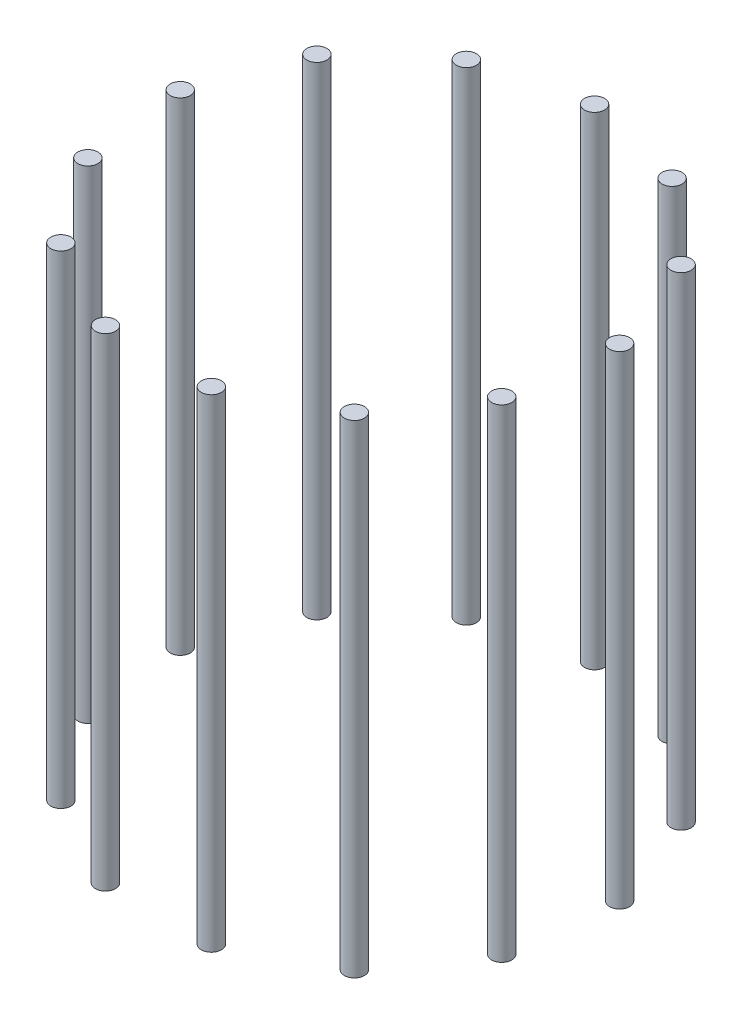
ISO-10303-21;
HEADER;
FILE_DESCRIPTION(('STEP AP214'),'2;1');
FILE_NAME('part.step','',(''),(''),'','','');
FILE_SCHEMA(('AUTOMOTIVE_DESIGN { 1 0 10303 214 1 1 1 1 }'));
ENDSEC;
DATA;
#1=APPLICATION_CONTEXT('core data for automotive mechanical design processes');
#2=APPLICATION_PROTOCOL_DEFINITION('international standard','automotive_design',2000,#1);
#3=PRODUCT_CONTEXT('',#1,'mechanical');
#4=PRODUCT('Part','Part','',(#3));
#5=PRODUCT_RELATED_PRODUCT_CATEGORY('part','',(#4));
#6=PRODUCT_DEFINITION_FORMATION('','',#4);
#7=PRODUCT_DEFINITION_CONTEXT('part definition',#1,'design');
#8=PRODUCT_DEFINITION('design','',#6,#7);
#9=PRODUCT_DEFINITION_SHAPE('','',#8);
#10=(LENGTH_UNIT() NAMED_UNIT(*) SI_UNIT(.MILLI.,.METRE.));
#11=(NAMED_UNIT(*) PLANE_ANGLE_UNIT() SI_UNIT($,.RADIAN.));
#12=(NAMED_UNIT(*) SI_UNIT($,.STERADIAN.) SOLID_ANGLE_UNIT());
#13=UNCERTAINTY_MEASURE_WITH_UNIT(LENGTH_MEASURE(1.E-05),#10,'distance_accuracy_value','');
#14=(GEOMETRIC_REPRESENTATION_CONTEXT(3) GLOBAL_UNCERTAINTY_ASSIGNED_CONTEXT((#13)) GLOBAL_UNIT_ASSIGNED_CONTEXT((#10,
#11,#12)) REPRESENTATION_CONTEXT('',''));
#15=CARTESIAN_POINT('',(0.,0.,0.));
#16=DIRECTION('',(0.,0.,1.));
#17=DIRECTION('',(1.,0.,0.));
#18=AXIS2_PLACEMENT_3D('',#15,#16,#17);
#19=CARTESIAN_POINT('',(-2.5559774462407,-12.,-4.87000814109254));
#20=DIRECTION('',(0.,1.,0.));
#21=DIRECTION('',(0.,0.,1.));
#22=AXIS2_PLACEMENT_3D('',#19,#20,#21);
#23=CYLINDRICAL_SURFACE('',#22,0.250000000000128);
#24=CARTESIAN_POINT('',(-2.5559774462407,-12.,-4.87000814109254));
#25=DIRECTION('',(0.,1.,0.));
#26=DIRECTION('',(0.,0.,1.));
#27=AXIS2_PLACEMENT_3D('',#24,#25,#26);
#28=CIRCLE('',#27,0.250000000000128);
#29=CARTESIAN_POINT('',(-2.5559774462407,-12.,-4.62000814109242));
#30=VERTEX_POINT('',#29);
#31=EDGE_CURVE('E11',#30,#30,#28,.T.);
#32=ORIENTED_EDGE('',*,*,#31,.T.);
#33=EDGE_LOOP('',(#32));
#34=FACE_BOUND('',#33,.T.);
#35=CARTESIAN_POINT('',(-2.5559774462407,0.,-4.87000814109254));
#36=DIRECTION('',(0.,1.,0.));
#37=DIRECTION('',(0.,0.,1.));
#38=AXIS2_PLACEMENT_3D('',#35,#36,#37);
#39=CIRCLE('',#38,0.250000000000128);
#40=CARTESIAN_POINT('',(-2.5559774462407,0.,-4.62000814109242));
#41=VERTEX_POINT('',#40);
#42=EDGE_CURVE('E42',#41,#41,#39,.T.);
#43=ORIENTED_EDGE('',*,*,#42,.F.);
#44=EDGE_LOOP('',(#43));
#45=FACE_BOUND('',#44,.T.);
#46=ADVANCED_FACE('F39',(#34,#45),#23,.T.);
#47=CARTESIAN_POINT('',(-2.5559774462407,-12.,-4.87000814109254));
#48=DIRECTION('',(0.,1.,0.));
#49=DIRECTION('',(0.,0.,1.));
#50=AXIS2_PLACEMENT_3D('',#47,#48,#49);
#51=PLANE('',#50);
#52=ORIENTED_EDGE('',*,*,#31,.F.);
#53=EDGE_LOOP('',(#52));
#54=FACE_BOUND('',#53,.T.);
#55=ADVANCED_FACE('F54',(#54),#51,.F.);
#56=CARTESIAN_POINT('',(-2.5559774462407,0.,-4.87000814109254));
#57=DIRECTION('',(0.,1.,0.));
#58=DIRECTION('',(0.,0.,1.));
#59=AXIS2_PLACEMENT_3D('',#56,#57,#58);
#60=PLANE('',#59);
#61=ORIENTED_EDGE('',*,*,#42,.T.);
#62=EDGE_LOOP('',(#61));
#63=FACE_BOUND('',#62,.T.);
#64=ADVANCED_FACE('F51',(#63),#60,.T.);
#65=CLOSED_SHELL('',(#46,#55,#64));
#66=MANIFOLD_SOLID_BREP('B2',#65);
#67=CARTESIAN_POINT('',(-4.52641126241501,-12.,-3.12435610702116));
#68=DIRECTION('',(0.,1.,0.));
#69=DIRECTION('',(0.,0.,1.));
#70=AXIS2_PLACEMENT_3D('',#67,#68,#69);
#71=CYLINDRICAL_SURFACE('',#70,0.250000000000218);
#72=CARTESIAN_POINT('',(-4.52641126241501,-12.,-3.12435610702116));
#73=DIRECTION('',(0.,1.,0.));
#74=DIRECTION('',(0.,0.,1.));
#75=AXIS2_PLACEMENT_3D('',#72,#73,#74);
#76=CIRCLE('',#75,0.250000000000218);
#77=CARTESIAN_POINT('',(-4.52641126241501,-12.,-2.87435610702095));
#78=VERTEX_POINT('',#77);
#79=EDGE_CURVE('E38',#78,#78,#76,.T.);
#80=ORIENTED_EDGE('',*,*,#79,.T.);
#81=EDGE_LOOP('',(#80));
#82=FACE_BOUND('',#81,.T.);
#83=CARTESIAN_POINT('',(-4.52641126241501,0.,-3.12435610702116));
#84=DIRECTION('',(0.,1.,0.));
#85=DIRECTION('',(0.,0.,1.));
#86=AXIS2_PLACEMENT_3D('',#83,#84,#85);
#87=CIRCLE('',#86,0.250000000000218);
#88=CARTESIAN_POINT('',(-4.52641126241501,0.,-2.87435610702095));
#89=VERTEX_POINT('',#88);
#90=EDGE_CURVE('E90',#89,#89,#87,.T.);
#91=ORIENTED_EDGE('',*,*,#90,.F.);
#92=EDGE_LOOP('',(#91));
#93=FACE_BOUND('',#92,.T.);
#94=ADVANCED_FACE('F87',(#82,#93),#71,.T.);
#95=CARTESIAN_POINT('',(-4.52641126241501,-12.,-3.12435610702116));
#96=DIRECTION('',(0.,1.,0.));
#97=DIRECTION('',(0.,0.,1.));
#98=AXIS2_PLACEMENT_3D('',#95,#96,#97);
#99=PLANE('',#98);
#100=ORIENTED_EDGE('',*,*,#79,.F.);
#101=EDGE_LOOP('',(#100));
#102=FACE_BOUND('',#101,.T.);
#103=ADVANCED_FACE('F102',(#102),#99,.F.);
#104=CARTESIAN_POINT('',(-4.52641126241501,0.,-3.12435610702116));
#105=DIRECTION('',(0.,1.,0.));
#106=DIRECTION('',(0.,0.,1.));
#107=AXIS2_PLACEMENT_3D('',#104,#105,#106);
#108=PLANE('',#107);
#109=ORIENTED_EDGE('',*,*,#90,.T.);
#110=EDGE_LOOP('',(#109));
#111=FACE_BOUND('',#110,.T.);
#112=ADVANCED_FACE('F99',(#111),#108,.T.);
#113=CLOSED_SHELL('',(#94,#103,#112));
#114=MANIFOLD_SOLID_BREP('B6',#113);
#115=CARTESIAN_POINT('',(-5.45989880753909,-12.,-0.662951741404041));
#116=DIRECTION('',(0.,1.,0.));
#117=DIRECTION('',(0.,0.,1.));
#118=AXIS2_PLACEMENT_3D('',#115,#116,#117);
#119=CYLINDRICAL_SURFACE('',#118,0.250000000000326);
#120=CARTESIAN_POINT('',(-5.45989880753909,-12.,-0.662951741404041));
#121=DIRECTION('',(0.,1.,0.));
#122=DIRECTION('',(0.,0.,1.));
#123=AXIS2_PLACEMENT_3D('',#120,#121,#122);
#124=CIRCLE('',#123,0.250000000000326);
#125=CARTESIAN_POINT('',(-5.45989880753909,-12.,-0.412951741403715));
#126=VERTEX_POINT('',#125);
#127=EDGE_CURVE('E86',#126,#126,#124,.T.);
#128=ORIENTED_EDGE('',*,*,#127,.T.);
#129=EDGE_LOOP('',(#128));
#130=FACE_BOUND('',#129,.T.);
#131=CARTESIAN_POINT('',(-5.45989880753909,0.,-0.662951741404041));
#132=DIRECTION('',(0.,1.,0.));
#133=DIRECTION('',(0.,0.,1.));
#134=AXIS2_PLACEMENT_3D('',#131,#132,#133);
#135=CIRCLE('',#134,0.250000000000326);
#136=CARTESIAN_POINT('',(-5.45989880753909,0.,-0.412951741403715));
#137=VERTEX_POINT('',#136);
#138=EDGE_CURVE('E138',#137,#137,#135,.T.);
#139=ORIENTED_EDGE('',*,*,#138,.F.);
#140=EDGE_LOOP('',(#139));
#141=FACE_BOUND('',#140,.T.);
#142=ADVANCED_FACE('F135',(#130,#141),#119,.T.);
#143=CARTESIAN_POINT('',(-5.45989880753909,-12.,-0.662951741404041));
#144=DIRECTION('',(0.,1.,0.));
#145=DIRECTION('',(0.,0.,1.));
#146=AXIS2_PLACEMENT_3D('',#143,#144,#145);
#147=PLANE('',#146);
#148=ORIENTED_EDGE('',*,*,#127,.F.);
#149=EDGE_LOOP('',(#148));
#150=FACE_BOUND('',#149,.T.);
#151=ADVANCED_FACE('F150',(#150),#147,.F.);
#152=CARTESIAN_POINT('',(-5.45989880753909,0.,-0.662951741404041));
#153=DIRECTION('',(0.,1.,0.));
#154=DIRECTION('',(0.,0.,1.));
#155=AXIS2_PLACEMENT_3D('',#152,#153,#154);
#156=PLANE('',#155);
#157=ORIENTED_EDGE('',*,*,#138,.T.);
#158=EDGE_LOOP('',(#157));
#159=FACE_BOUND('',#158,.T.);
#160=ADVANCED_FACE('F147',(#159),#156,.T.);
#161=CLOSED_SHELL('',(#142,#151,#160));
#162=MANIFOLD_SOLID_BREP('B33',#161);
#163=CARTESIAN_POINT('',(-5.14258933476946,-12.,1.95032687873417));
#164=DIRECTION('',(0.,1.,0.));
#165=DIRECTION('',(0.,0.,1.));
#166=AXIS2_PLACEMENT_3D('',#163,#164,#165);
#167=CYLINDRICAL_SURFACE('',#166,0.250000000000417);
#168=CARTESIAN_POINT('',(-5.14258933476946,-12.,1.95032687873417));
#169=DIRECTION('',(0.,1.,0.));
#170=DIRECTION('',(0.,0.,1.));
#171=AXIS2_PLACEMENT_3D('',#168,#169,#170);
#172=CIRCLE('',#171,0.250000000000417);
#173=CARTESIAN_POINT('',(-5.14258933476946,-12.,2.20032687873458));
#174=VERTEX_POINT('',#173);
#175=EDGE_CURVE('E134',#174,#174,#172,.T.);
#176=ORIENTED_EDGE('',*,*,#175,.T.);
#177=EDGE_LOOP('',(#176));
#178=FACE_BOUND('',#177,.T.);
#179=CARTESIAN_POINT('',(-5.14258933476946,0.,1.95032687873417));
#180=DIRECTION('',(0.,1.,0.));
#181=DIRECTION('',(0.,0.,1.));
#182=AXIS2_PLACEMENT_3D('',#179,#180,#181);
#183=CIRCLE('',#182,0.250000000000417);
#184=CARTESIAN_POINT('',(-5.14258933476946,0.,2.20032687873458));
#185=VERTEX_POINT('',#184);
#186=EDGE_CURVE('E186',#185,#185,#183,.T.);
#187=ORIENTED_EDGE('',*,*,#186,.F.);
#188=EDGE_LOOP('',(#187));
#189=FACE_BOUND('',#188,.T.);
#190=ADVANCED_FACE('F183',(#178,#189),#167,.T.);
#191=CARTESIAN_POINT('',(-5.14258933476946,-12.,1.95032687873417));
#192=DIRECTION('',(0.,1.,0.));
#193=DIRECTION('',(0.,0.,1.));
#194=AXIS2_PLACEMENT_3D('',#191,#192,#193);
#195=PLANE('',#194);
#196=ORIENTED_EDGE('',*,*,#175,.F.);
#197=EDGE_LOOP('',(#196));
#198=FACE_BOUND('',#197,.T.);
#199=ADVANCED_FACE('F198',(#198),#195,.F.);
#200=CARTESIAN_POINT('',(-5.14258933476946,0.,1.95032687873417));
#201=DIRECTION('',(0.,1.,0.));
#202=DIRECTION('',(0.,0.,1.));
#203=AXIS2_PLACEMENT_3D('',#200,#201,#202);
#204=PLANE('',#203);
#205=ORIENTED_EDGE('',*,*,#186,.T.);
#206=EDGE_LOOP('',(#205));
#207=FACE_BOUND('',#206,.T.);
#208=ADVANCED_FACE('F195',(#207),#204,.T.);
#209=CLOSED_SHELL('',(#190,#199,#208));
#210=MANIFOLD_SOLID_BREP('B81',#209);
#211=CARTESIAN_POINT('',(-3.64717462032396,-12.,4.11680911494121));
#212=DIRECTION('',(0.,1.,0.));
#213=DIRECTION('',(0.,0.,1.));
#214=AXIS2_PLACEMENT_3D('',#211,#212,#213);
#215=CYLINDRICAL_SURFACE('',#214,0.250000000000482);
#216=CARTESIAN_POINT('',(-3.64717462032396,-12.,4.11680911494121));
#217=DIRECTION('',(0.,1.,0.));
#218=DIRECTION('',(0.,0.,1.));
#219=AXIS2_PLACEMENT_3D('',#216,#217,#218);
#220=CIRCLE('',#219,0.250000000000482);
#221=CARTESIAN_POINT('',(-3.64717462032396,-12.,4.36680911494169));
#222=VERTEX_POINT('',#221);
#223=EDGE_CURVE('E182',#222,#222,#220,.T.);
#224=ORIENTED_EDGE('',*,*,#223,.T.);
#225=EDGE_LOOP('',(#224));
#226=FACE_BOUND('',#225,.T.);
#227=CARTESIAN_POINT('',(-3.64717462032396,0.,4.11680911494121));
#228=DIRECTION('',(0.,1.,0.));
#229=DIRECTION('',(0.,0.,1.));
#230=AXIS2_PLACEMENT_3D('',#227,#228,#229);
#231=CIRCLE('',#230,0.250000000000482);
#232=CARTESIAN_POINT('',(-3.64717462032396,0.,4.36680911494169));
#233=VERTEX_POINT('',#232);
#234=EDGE_CURVE('E234',#233,#233,#231,.T.);
#235=ORIENTED_EDGE('',*,*,#234,.F.);
#236=EDGE_LOOP('',(#235));
#237=FACE_BOUND('',#236,.T.);
#238=ADVANCED_FACE('F231',(#226,#237),#215,.T.);
#239=CARTESIAN_POINT('',(-3.64717462032396,-12.,4.11680911494121));
#240=DIRECTION('',(0.,1.,0.));
#241=DIRECTION('',(0.,0.,1.));
#242=AXIS2_PLACEMENT_3D('',#239,#240,#241);
#243=PLANE('',#242);
#244=ORIENTED_EDGE('',*,*,#223,.F.);
#245=EDGE_LOOP('',(#244));
#246=FACE_BOUND('',#245,.T.);
#247=ADVANCED_FACE('F246',(#246),#243,.F.);
#248=CARTESIAN_POINT('',(-3.64717462032396,0.,4.11680911494121));
#249=DIRECTION('',(0.,1.,0.));
#250=DIRECTION('',(0.,0.,1.));
#251=AXIS2_PLACEMENT_3D('',#248,#249,#250);
#252=PLANE('',#251);
#253=ORIENTED_EDGE('',*,*,#234,.T.);
#254=EDGE_LOOP('',(#253));
#255=FACE_BOUND('',#254,.T.);
#256=ADVANCED_FACE('F243',(#255),#252,.T.);
#257=CLOSED_SHELL('',(#238,#247,#256));
#258=MANIFOLD_SOLID_BREP('B129',#257);
#259=CARTESIAN_POINT('',(-1.31623615358111,-12.,5.34017999584334));
#260=DIRECTION('',(0.,1.,0.));
#261=DIRECTION('',(0.,0.,1.));
#262=AXIS2_PLACEMENT_3D('',#259,#260,#261);
#263=CYLINDRICAL_SURFACE('',#262,0.250000000000497);
#264=CARTESIAN_POINT('',(-1.31623615358111,-12.,5.34017999584334));
#265=DIRECTION('',(0.,1.,0.));
#266=DIRECTION('',(0.,0.,1.));
#267=AXIS2_PLACEMENT_3D('',#264,#265,#266);
#268=CIRCLE('',#267,0.250000000000497);
#269=CARTESIAN_POINT('',(-1.31623615358111,-12.,5.59017999584384));
#270=VERTEX_POINT('',#269);
#271=EDGE_CURVE('E230',#270,#270,#268,.T.);
#272=ORIENTED_EDGE('',*,*,#271,.T.);
#273=EDGE_LOOP('',(#272));
#274=FACE_BOUND('',#273,.T.);
#275=CARTESIAN_POINT('',(-1.31623615358111,0.,5.34017999584334));
#276=DIRECTION('',(0.,1.,0.));
#277=DIRECTION('',(0.,0.,1.));
#278=AXIS2_PLACEMENT_3D('',#275,#276,#277);
#279=CIRCLE('',#278,0.250000000000497);
#280=CARTESIAN_POINT('',(-1.31623615358111,0.,5.59017999584384));
#281=VERTEX_POINT('',#280);
#282=EDGE_CURVE('E282',#281,#281,#279,.T.);
#283=ORIENTED_EDGE('',*,*,#282,.F.);
#284=EDGE_LOOP('',(#283));
#285=FACE_BOUND('',#284,.T.);
#286=ADVANCED_FACE('F279',(#274,#285),#263,.T.);
#287=CARTESIAN_POINT('',(-1.31623615358111,-12.,5.34017999584334));
#288=DIRECTION('',(0.,1.,0.));
#289=DIRECTION('',(0.,0.,1.));
#290=AXIS2_PLACEMENT_3D('',#287,#288,#289);
#291=PLANE('',#290);
#292=ORIENTED_EDGE('',*,*,#271,.F.);
#293=EDGE_LOOP('',(#292));
#294=FACE_BOUND('',#293,.T.);
#295=ADVANCED_FACE('F294',(#294),#291,.F.);
#296=CARTESIAN_POINT('',(-1.31623615358111,0.,5.34017999584334));
#297=DIRECTION('',(0.,1.,0.));
#298=DIRECTION('',(0.,0.,1.));
#299=AXIS2_PLACEMENT_3D('',#296,#297,#298);
#300=PLANE('',#299);
#301=ORIENTED_EDGE('',*,*,#282,.T.);
#302=EDGE_LOOP('',(#301));
#303=FACE_BOUND('',#302,.T.);
#304=ADVANCED_FACE('F291',(#303),#300,.T.);
#305=CLOSED_SHELL('',(#286,#295,#304));
#306=MANIFOLD_SOLID_BREP('B177',#305);
#307=CARTESIAN_POINT('',(1.31623615358203,-12.,5.34017999584323));
#308=DIRECTION('',(0.,1.,0.));
#309=DIRECTION('',(0.,0.,1.));
#310=AXIS2_PLACEMENT_3D('',#307,#308,#309);
#311=CYLINDRICAL_SURFACE('',#310,0.250000000000458);
#312=CARTESIAN_POINT('',(1.31623615358203,-12.,5.34017999584323));
#313=DIRECTION('',(0.,1.,0.));
#314=DIRECTION('',(0.,0.,1.));
#315=AXIS2_PLACEMENT_3D('',#312,#313,#314);
#316=CIRCLE('',#315,0.250000000000458);
#317=CARTESIAN_POINT('',(1.31623615358203,-12.,5.59017999584369));
#318=VERTEX_POINT('',#317);
#319=EDGE_CURVE('E278',#318,#318,#316,.T.);
#320=ORIENTED_EDGE('',*,*,#319,.T.);
#321=EDGE_LOOP('',(#320));
#322=FACE_BOUND('',#321,.T.);
#323=CARTESIAN_POINT('',(1.31623615358203,0.,5.34017999584323));
#324=DIRECTION('',(0.,1.,0.));
#325=DIRECTION('',(0.,0.,1.));
#326=AXIS2_PLACEMENT_3D('',#323,#324,#325);
#327=CIRCLE('',#326,0.250000000000458);
#328=CARTESIAN_POINT('',(1.31623615358203,0.,5.59017999584369));
#329=VERTEX_POINT('',#328);
#330=EDGE_CURVE('E330',#329,#329,#327,.T.);
#331=ORIENTED_EDGE('',*,*,#330,.F.);
#332=EDGE_LOOP('',(#331));
#333=FACE_BOUND('',#332,.T.);
#334=ADVANCED_FACE('F327',(#322,#333),#311,.T.);
#335=CARTESIAN_POINT('',(1.31623615358203,-12.,5.34017999584323));
#336=DIRECTION('',(0.,1.,0.));
#337=DIRECTION('',(0.,0.,1.));
#338=AXIS2_PLACEMENT_3D('',#335,#336,#337);
#339=PLANE('',#338);
#340=ORIENTED_EDGE('',*,*,#319,.F.);
#341=EDGE_LOOP('',(#340));
#342=FACE_BOUND('',#341,.T.);
#343=ADVANCED_FACE('F342',(#342),#339,.F.);
#344=CARTESIAN_POINT('',(1.31623615358203,0.,5.34017999584323));
#345=DIRECTION('',(0.,1.,0.));
#346=DIRECTION('',(0.,0.,1.));
#347=AXIS2_PLACEMENT_3D('',#344,#345,#346);
#348=PLANE('',#347);
#349=ORIENTED_EDGE('',*,*,#330,.T.);
#350=EDGE_LOOP('',(#349));
#351=FACE_BOUND('',#350,.T.);
#352=ADVANCED_FACE('F339',(#351),#348,.T.);
#353=CLOSED_SHELL('',(#334,#343,#352));
#354=MANIFOLD_SOLID_BREP('B225',#353);
#355=CARTESIAN_POINT('',(3.64717462032478,-12.,4.1168091149409));
#356=DIRECTION('',(0.,1.,0.));
#357=DIRECTION('',(0.,0.,1.));
#358=AXIS2_PLACEMENT_3D('',#355,#356,#357);
#359=CYLINDRICAL_SURFACE('',#358,0.250000000000372);
#360=CARTESIAN_POINT('',(3.64717462032478,-12.,4.1168091149409));
#361=DIRECTION('',(0.,1.,0.));
#362=DIRECTION('',(0.,0.,1.));
#363=AXIS2_PLACEMENT_3D('',#360,#361,#362);
#364=CIRCLE('',#363,0.250000000000372);
#365=CARTESIAN_POINT('',(3.64717462032478,-12.,4.36680911494127));
#366=VERTEX_POINT('',#365);
#367=EDGE_CURVE('E326',#366,#366,#364,.T.);
#368=ORIENTED_EDGE('',*,*,#367,.T.);
#369=EDGE_LOOP('',(#368));
#370=FACE_BOUND('',#369,.T.);
#371=CARTESIAN_POINT('',(3.64717462032478,0.,4.1168091149409));
#372=DIRECTION('',(0.,1.,0.));
#373=DIRECTION('',(0.,0.,1.));
#374=AXIS2_PLACEMENT_3D('',#371,#372,#373);
#375=CIRCLE('',#374,0.250000000000372);
#376=CARTESIAN_POINT('',(3.64717462032478,0.,4.36680911494127));
#377=VERTEX_POINT('',#376);
#378=EDGE_CURVE('E378',#377,#377,#375,.T.);
#379=ORIENTED_EDGE('',*,*,#378,.F.);
#380=EDGE_LOOP('',(#379));
#381=FACE_BOUND('',#380,.T.);
#382=ADVANCED_FACE('F375',(#370,#381),#359,.T.);
#383=CARTESIAN_POINT('',(3.64717462032478,-12.,4.1168091149409));
#384=DIRECTION('',(0.,1.,0.));
#385=DIRECTION('',(0.,0.,1.));
#386=AXIS2_PLACEMENT_3D('',#383,#384,#385);
#387=PLANE('',#386);
#388=ORIENTED_EDGE('',*,*,#367,.F.);
#389=EDGE_LOOP('',(#388));
#390=FACE_BOUND('',#389,.T.);
#391=ADVANCED_FACE('F390',(#390),#387,.F.);
#392=CARTESIAN_POINT('',(3.64717462032478,0.,4.1168091149409));
#393=DIRECTION('',(0.,1.,0.));
#394=DIRECTION('',(0.,0.,1.));
#395=AXIS2_PLACEMENT_3D('',#392,#393,#394);
#396=PLANE('',#395);
#397=ORIENTED_EDGE('',*,*,#378,.T.);
#398=EDGE_LOOP('',(#397));
#399=FACE_BOUND('',#398,.T.);
#400=ADVANCED_FACE('F387',(#399),#396,.T.);
#401=CLOSED_SHELL('',(#382,#391,#400));
#402=MANIFOLD_SOLID_BREP('B273',#401);
#403=CARTESIAN_POINT('',(5.1425893347701,-12.,1.95032687873373));
#404=DIRECTION('',(0.,1.,0.));
#405=DIRECTION('',(0.,0.,1.));
#406=AXIS2_PLACEMENT_3D('',#403,#404,#405);
#407=CYLINDRICAL_SURFACE('',#406,0.250000000000262);
#408=CARTESIAN_POINT('',(5.1425893347701,-12.,1.95032687873373));
#409=DIRECTION('',(0.,1.,0.));
#410=DIRECTION('',(0.,0.,1.));
#411=AXIS2_PLACEMENT_3D('',#408,#409,#410);
#412=CIRCLE('',#411,0.250000000000262);
#413=CARTESIAN_POINT('',(5.1425893347701,-12.,2.20032687873399));
#414=VERTEX_POINT('',#413);
#415=EDGE_CURVE('E374',#414,#414,#412,.T.);
#416=ORIENTED_EDGE('',*,*,#415,.T.);
#417=EDGE_LOOP('',(#416));
#418=FACE_BOUND('',#417,.T.);
#419=CARTESIAN_POINT('',(5.1425893347701,0.,1.95032687873373));
#420=DIRECTION('',(0.,1.,0.));
#421=DIRECTION('',(0.,0.,1.));
#422=AXIS2_PLACEMENT_3D('',#419,#420,#421);
#423=CIRCLE('',#422,0.250000000000262);
#424=CARTESIAN_POINT('',(5.1425893347701,0.,2.20032687873399));
#425=VERTEX_POINT('',#424);
#426=EDGE_CURVE('E426',#425,#425,#423,.T.);
#427=ORIENTED_EDGE('',*,*,#426,.F.);
#428=EDGE_LOOP('',(#427));
#429=FACE_BOUND('',#428,.T.);
#430=ADVANCED_FACE('F423',(#418,#429),#407,.T.);
#431=CARTESIAN_POINT('',(5.1425893347701,-12.,1.95032687873373));
#432=DIRECTION('',(0.,1.,0.));
#433=DIRECTION('',(0.,0.,1.));
#434=AXIS2_PLACEMENT_3D('',#431,#432,#433);
#435=PLANE('',#434);
#436=ORIENTED_EDGE('',*,*,#415,.F.);
#437=EDGE_LOOP('',(#436));
#438=FACE_BOUND('',#437,.T.);
#439=ADVANCED_FACE('F438',(#438),#435,.F.);
#440=CARTESIAN_POINT('',(5.1425893347701,0.,1.95032687873373));
#441=DIRECTION('',(0.,1.,0.));
#442=DIRECTION('',(0.,0.,1.));
#443=AXIS2_PLACEMENT_3D('',#440,#441,#442);
#444=PLANE('',#443);
#445=ORIENTED_EDGE('',*,*,#426,.T.);
#446=EDGE_LOOP('',(#445));
#447=FACE_BOUND('',#446,.T.);
#448=ADVANCED_FACE('F435',(#447),#444,.T.);
#449=CLOSED_SHELL('',(#430,#439,#448));
#450=MANIFOLD_SOLID_BREP('B321',#449);
#451=CARTESIAN_POINT('',(5.4598988075395,-12.,-0.66295174140451));
#452=DIRECTION('',(0.,1.,0.));
#453=DIRECTION('',(0.,0.,1.));
#454=AXIS2_PLACEMENT_3D('',#451,#452,#453);
#455=CYLINDRICAL_SURFACE('',#454,0.250000000000146);
#456=CARTESIAN_POINT('',(5.4598988075395,-12.,-0.66295174140451));
#457=DIRECTION('',(0.,1.,0.));
#458=DIRECTION('',(0.,0.,1.));
#459=AXIS2_PLACEMENT_3D('',#456,#457,#458);
#460=CIRCLE('',#459,0.250000000000146);
#461=CARTESIAN_POINT('',(5.4598988075395,-12.,-0.412951741404363));
#462=VERTEX_POINT('',#461);
#463=EDGE_CURVE('E422',#462,#462,#460,.T.);
#464=ORIENTED_EDGE('',*,*,#463,.T.);
#465=EDGE_LOOP('',(#464));
#466=FACE_BOUND('',#465,.T.);
#467=CARTESIAN_POINT('',(5.4598988075395,0.,-0.66295174140451));
#468=DIRECTION('',(0.,1.,0.));
#469=DIRECTION('',(0.,0.,1.));
#470=AXIS2_PLACEMENT_3D('',#467,#468,#469);
#471=CIRCLE('',#470,0.250000000000146);
#472=CARTESIAN_POINT('',(5.4598988075395,0.,-0.412951741404363));
#473=VERTEX_POINT('',#472);
#474=EDGE_CURVE('E474',#473,#473,#471,.T.);
#475=ORIENTED_EDGE('',*,*,#474,.F.);
#476=EDGE_LOOP('',(#475));
#477=FACE_BOUND('',#476,.T.);
#478=ADVANCED_FACE('F471',(#466,#477),#455,.T.);
#479=CARTESIAN_POINT('',(5.4598988075395,-12.,-0.66295174140451));
#480=DIRECTION('',(0.,1.,0.));
#481=DIRECTION('',(0.,0.,1.));
#482=AXIS2_PLACEMENT_3D('',#479,#480,#481);
#483=PLANE('',#482);
#484=ORIENTED_EDGE('',*,*,#463,.F.);
#485=EDGE_LOOP('',(#484));
#486=FACE_BOUND('',#485,.T.);
#487=ADVANCED_FACE('F486',(#486),#483,.F.);
#488=CARTESIAN_POINT('',(5.4598988075395,0.,-0.66295174140451));
#489=DIRECTION('',(0.,1.,0.));
#490=DIRECTION('',(0.,0.,1.));
#491=AXIS2_PLACEMENT_3D('',#488,#489,#490);
#492=PLANE('',#491);
#493=ORIENTED_EDGE('',*,*,#474,.T.);
#494=EDGE_LOOP('',(#493));
#495=FACE_BOUND('',#494,.T.);
#496=ADVANCED_FACE('F483',(#495),#492,.T.);
#497=CLOSED_SHELL('',(#478,#487,#496));
#498=MANIFOLD_SOLID_BREP('B369',#497);
#499=CARTESIAN_POINT('',(4.52641126241521,-12.,-3.12435610702155));
#500=DIRECTION('',(0.,1.,0.));
#501=DIRECTION('',(0.,0.,1.));
#502=AXIS2_PLACEMENT_3D('',#499,#500,#501);
#503=CYLINDRICAL_SURFACE('',#502,0.250000000000052);
#504=CARTESIAN_POINT('',(4.52641126241521,-12.,-3.12435610702155));
#505=DIRECTION('',(0.,1.,0.));
#506=DIRECTION('',(0.,0.,1.));
#507=AXIS2_PLACEMENT_3D('',#504,#505,#506);
#508=CIRCLE('',#507,0.250000000000052);
#509=CARTESIAN_POINT('',(4.52641126241521,-12.,-2.8743561070215));
#510=VERTEX_POINT('',#509);
#511=EDGE_CURVE('E470',#510,#510,#508,.T.);
#512=ORIENTED_EDGE('',*,*,#511,.T.);
#513=EDGE_LOOP('',(#512));
#514=FACE_BOUND('',#513,.T.);
#515=CARTESIAN_POINT('',(4.52641126241521,0.,-3.12435610702155));
#516=DIRECTION('',(0.,1.,0.));
#517=DIRECTION('',(0.,0.,1.));
#518=AXIS2_PLACEMENT_3D('',#515,#516,#517);
#519=CIRCLE('',#518,0.250000000000052);
#520=CARTESIAN_POINT('',(4.52641126241521,0.,-2.8743561070215));
#521=VERTEX_POINT('',#520);
#522=EDGE_CURVE('E522',#521,#521,#519,.T.);
#523=ORIENTED_EDGE('',*,*,#522,.F.);
#524=EDGE_LOOP('',(#523));
#525=FACE_BOUND('',#524,.T.);
#526=ADVANCED_FACE('F519',(#514,#525),#503,.T.);
#527=CARTESIAN_POINT('',(4.52641126241521,-12.,-3.12435610702155));
#528=DIRECTION('',(0.,1.,0.));
#529=DIRECTION('',(0.,0.,1.));
#530=AXIS2_PLACEMENT_3D('',#527,#528,#529);
#531=PLANE('',#530);
#532=ORIENTED_EDGE('',*,*,#511,.F.);
#533=EDGE_LOOP('',(#532));
#534=FACE_BOUND('',#533,.T.);
#535=ADVANCED_FACE('F534',(#534),#531,.F.);
#536=CARTESIAN_POINT('',(4.52641126241521,0.,-3.12435610702155));
#537=DIRECTION('',(0.,1.,0.));
#538=DIRECTION('',(0.,0.,1.));
#539=AXIS2_PLACEMENT_3D('',#536,#537,#538);
#540=PLANE('',#539);
#541=ORIENTED_EDGE('',*,*,#522,.T.);
#542=EDGE_LOOP('',(#541));
#543=FACE_BOUND('',#542,.T.);
#544=ADVANCED_FACE('F531',(#543),#540,.T.);
#545=CLOSED_SHELL('',(#526,#535,#544));
#546=MANIFOLD_SOLID_BREP('B417',#545);
#547=CARTESIAN_POINT('',(2.55597744624073,-12.,-4.87000814109265));
#548=DIRECTION('',(0.,1.,0.));
#549=DIRECTION('',(0.,0.,1.));
#550=AXIS2_PLACEMENT_3D('',#547,#548,#549);
#551=CYLINDRICAL_SURFACE('',#550,0.25);
#552=CARTESIAN_POINT('',(2.55597744624073,-12.,-4.87000814109265));
#553=DIRECTION('',(0.,1.,0.));
#554=DIRECTION('',(0.,0.,1.));
#555=AXIS2_PLACEMENT_3D('',#552,#553,#554);
#556=CIRCLE('',#555,0.25);
#557=CARTESIAN_POINT('',(2.55597744624073,-12.,-4.62000814109265));
#558=VERTEX_POINT('',#557);
#559=EDGE_CURVE('E518',#558,#558,#556,.T.);
#560=ORIENTED_EDGE('',*,*,#559,.T.);
#561=EDGE_LOOP('',(#560));
#562=FACE_BOUND('',#561,.T.);
#563=CARTESIAN_POINT('',(2.55597744624073,0.,-4.87000814109265));
#564=DIRECTION('',(0.,1.,0.));
#565=DIRECTION('',(0.,0.,1.));
#566=AXIS2_PLACEMENT_3D('',#563,#564,#565);
#567=CIRCLE('',#566,0.25);
#568=CARTESIAN_POINT('',(2.55597744624073,0.,-4.62000814109265));
#569=VERTEX_POINT('',#568);
#570=EDGE_CURVE('E569',#569,#569,#567,.T.);
#571=ORIENTED_EDGE('',*,*,#570,.F.);
#572=EDGE_LOOP('',(#571));
#573=FACE_BOUND('',#572,.T.);
#574=ADVANCED_FACE('F566',(#562,#573),#551,.T.);
#575=CARTESIAN_POINT('',(2.55597744624073,-12.,-4.87000814109265));
#576=DIRECTION('',(0.,1.,0.));
#577=DIRECTION('',(0.,0.,1.));
#578=AXIS2_PLACEMENT_3D('',#575,#576,#577);
#579=PLANE('',#578);
#580=ORIENTED_EDGE('',*,*,#559,.F.);
#581=EDGE_LOOP('',(#580));
#582=FACE_BOUND('',#581,.T.);
#583=ADVANCED_FACE('F581',(#582),#579,.F.);
#584=CARTESIAN_POINT('',(2.55597744624073,0.,-4.87000814109265));
#585=DIRECTION('',(0.,1.,0.));
#586=DIRECTION('',(0.,0.,1.));
#587=AXIS2_PLACEMENT_3D('',#584,#585,#586);
#588=PLANE('',#587);
#589=ORIENTED_EDGE('',*,*,#570,.T.);
#590=EDGE_LOOP('',(#589));
#591=FACE_BOUND('',#590,.T.);
#592=ADVANCED_FACE('F578',(#591),#588,.T.);
#593=CLOSED_SHELL('',(#574,#583,#592));
#594=MANIFOLD_SOLID_BREP('B465',#593);
#595=CARTESIAN_POINT('',(0.,-12.,-5.5));
#596=DIRECTION('',(0.,1.,0.));
#597=DIRECTION('',(0.,0.,1.));
#598=AXIS2_PLACEMENT_3D('',#595,#596,#597);
#599=CYLINDRICAL_SURFACE('',#598,0.25);
#600=CARTESIAN_POINT('',(0.,-12.,-5.5));
#601=DIRECTION('',(0.,1.,0.));
#602=DIRECTION('',(0.,0.,1.));
#603=AXIS2_PLACEMENT_3D('',#600,#601,#602);
#604=CIRCLE('',#603,0.25);
#605=CARTESIAN_POINT('',(0.,-12.,-5.25));
#606=VERTEX_POINT('',#605);
#607=EDGE_CURVE('E565',#606,#606,#604,.T.);
#608=ORIENTED_EDGE('',*,*,#607,.T.);
#609=EDGE_LOOP('',(#608));
#610=FACE_BOUND('',#609,.T.);
#611=CARTESIAN_POINT('',(0.,0.,-5.5));
#612=DIRECTION('',(0.,1.,0.));
#613=DIRECTION('',(0.,0.,1.));
#614=AXIS2_PLACEMENT_3D('',#611,#612,#613);
#615=CIRCLE('',#614,0.25);
#616=CARTESIAN_POINT('',(0.,0.,-5.25));
#617=VERTEX_POINT('',#616);
#618=EDGE_CURVE('E609',#617,#617,#615,.T.);
#619=ORIENTED_EDGE('',*,*,#618,.F.);
#620=EDGE_LOOP('',(#619));
#621=FACE_BOUND('',#620,.T.);
#622=ADVANCED_FACE('F606',(#610,#621),#599,.T.);
#623=CARTESIAN_POINT('',(0.,-12.,-5.5));
#624=DIRECTION('',(0.,1.,0.));
#625=DIRECTION('',(0.,0.,1.));
#626=AXIS2_PLACEMENT_3D('',#623,#624,#625);
#627=PLANE('',#626);
#628=ORIENTED_EDGE('',*,*,#607,.F.);
#629=EDGE_LOOP('',(#628));
#630=FACE_BOUND('',#629,.T.);
#631=ADVANCED_FACE('F621',(#630),#627,.F.);
#632=CARTESIAN_POINT('',(0.,0.,-5.5));
#633=DIRECTION('',(0.,1.,0.));
#634=DIRECTION('',(0.,0.,1.));
#635=AXIS2_PLACEMENT_3D('',#632,#633,#634);
#636=PLANE('',#635);
#637=ORIENTED_EDGE('',*,*,#618,.T.);
#638=EDGE_LOOP('',(#637));
#639=FACE_BOUND('',#638,.T.);
#640=ADVANCED_FACE('F618',(#639),#636,.T.);
#641=CLOSED_SHELL('',(#622,#631,#640));
#642=MANIFOLD_SOLID_BREP('B513',#641);
#643=ADVANCED_BREP_SHAPE_REPRESENTATION('',(#18,#66,#114,#162,#210,#258,#306,#354,#402,#450,
#498,#546,#594,#642),#14);
#644=SHAPE_DEFINITION_REPRESENTATION(#9,#643);
ENDSEC;
END-ISO-10303-21;
